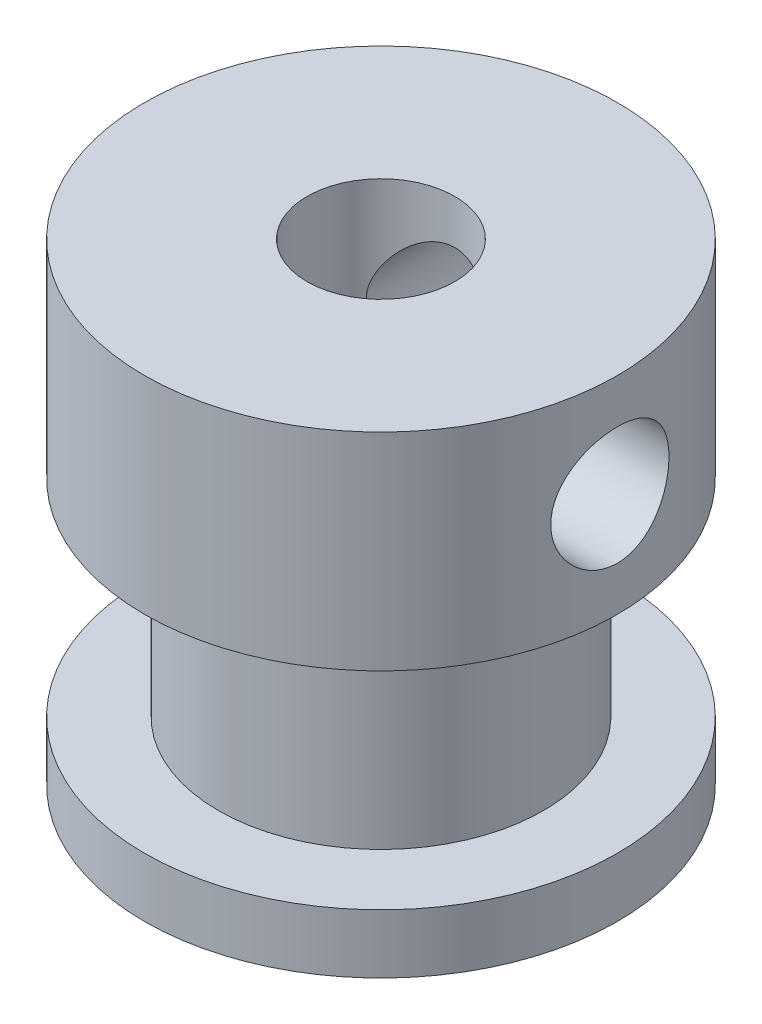
ISO-10303-21;
HEADER;
FILE_DESCRIPTION(('STEP AP214'),'2;1');
FILE_NAME('part.step','',(''),(''),'','','');
FILE_SCHEMA(('AUTOMOTIVE_DESIGN { 1 0 10303 214 1 1 1 1 }'));
ENDSEC;
DATA;
#1=APPLICATION_CONTEXT('core data for automotive mechanical design processes');
#2=APPLICATION_PROTOCOL_DEFINITION('international standard','automotive_design',2000,#1);
#3=PRODUCT_CONTEXT('',#1,'mechanical');
#4=PRODUCT('Part','Part','',(#3));
#5=PRODUCT_RELATED_PRODUCT_CATEGORY('part','',(#4));
#6=PRODUCT_DEFINITION_FORMATION('','',#4);
#7=PRODUCT_DEFINITION_CONTEXT('part definition',#1,'design');
#8=PRODUCT_DEFINITION('design','',#6,#7);
#9=PRODUCT_DEFINITION_SHAPE('','',#8);
#10=(LENGTH_UNIT() NAMED_UNIT(*) SI_UNIT(.MILLI.,.METRE.));
#11=(NAMED_UNIT(*) PLANE_ANGLE_UNIT() SI_UNIT($,.RADIAN.));
#12=(NAMED_UNIT(*) SI_UNIT($,.STERADIAN.) SOLID_ANGLE_UNIT());
#13=UNCERTAINTY_MEASURE_WITH_UNIT(LENGTH_MEASURE(1.E-05),#10,'distance_accuracy_value','');
#14=(GEOMETRIC_REPRESENTATION_CONTEXT(3) GLOBAL_UNCERTAINTY_ASSIGNED_CONTEXT((#13)) GLOBAL_UNIT_ASSIGNED_CONTEXT((#10,
#11,#12)) REPRESENTATION_CONTEXT('',''));
#15=CARTESIAN_POINT('',(0.,0.,0.));
#16=DIRECTION('',(0.,0.,1.));
#17=DIRECTION('',(1.,0.,0.));
#18=AXIS2_PLACEMENT_3D('',#15,#16,#17);
#19=CARTESIAN_POINT('',(0.,2.,0.));
#20=DIRECTION('',(0.,-1.,0.));
#21=DIRECTION('',(0.,0.,-1.));
#22=AXIS2_PLACEMENT_3D('',#19,#20,#21);
#23=CYLINDRICAL_SURFACE('',#22,8.);
#24=CARTESIAN_POINT('',(0.,2.,0.));
#25=DIRECTION('',(0.,1.,0.));
#26=DIRECTION('',(0.,0.,1.));
#27=AXIS2_PLACEMENT_3D('',#24,#25,#26);
#28=CIRCLE('',#27,8.);
#29=CARTESIAN_POINT('',(0.,2.,8.));
#30=VERTEX_POINT('',#29);
#31=EDGE_CURVE('E126',#30,#30,#28,.T.);
#32=ORIENTED_EDGE('',*,*,#31,.F.);
#33=EDGE_LOOP('',(#32));
#34=FACE_BOUND('',#33,.T.);
#35=CARTESIAN_POINT('',(0.,0.,0.));
#36=DIRECTION('',(0.,1.,0.));
#37=DIRECTION('',(0.,0.,1.));
#38=AXIS2_PLACEMENT_3D('',#35,#36,#37);
#39=CIRCLE('',#38,8.);
#40=CARTESIAN_POINT('',(0.,0.,8.));
#41=VERTEX_POINT('',#40);
#42=EDGE_CURVE('E77',#41,#41,#39,.T.);
#43=ORIENTED_EDGE('',*,*,#42,.T.);
#44=EDGE_LOOP('',(#43));
#45=FACE_BOUND('',#44,.T.);
#46=ADVANCED_FACE('F38',(#34,#45),#23,.T.);
#47=CARTESIAN_POINT('',(0.,2.,0.));
#48=DIRECTION('',(0.,1.,0.));
#49=DIRECTION('',(0.,0.,1.));
#50=AXIS2_PLACEMENT_3D('',#47,#48,#49);
#51=PLANE('',#50);
#52=CARTESIAN_POINT('',(0.,2.,0.));
#53=DIRECTION('',(0.,1.,0.));
#54=DIRECTION('',(0.,0.,1.));
#55=AXIS2_PLACEMENT_3D('',#52,#53,#54);
#56=CIRCLE('',#55,5.5);
#57=CARTESIAN_POINT('',(0.,2.,5.5));
#58=VERTEX_POINT('',#57);
#59=EDGE_CURVE('E45',#58,#58,#56,.T.);
#60=ORIENTED_EDGE('',*,*,#59,.F.);
#61=EDGE_LOOP('',(#60));
#62=FACE_BOUND('',#61,.T.);
#63=ORIENTED_EDGE('',*,*,#31,.T.);
#64=EDGE_LOOP('',(#63));
#65=FACE_BOUND('',#64,.T.);
#66=ADVANCED_FACE('F110',(#62,#65),#51,.T.);
#67=CARTESIAN_POINT('',(0.,0.,0.));
#68=DIRECTION('',(0.,1.,0.));
#69=DIRECTION('',(0.,0.,1.));
#70=AXIS2_PLACEMENT_3D('',#67,#68,#69);
#71=PLANE('',#70);
#72=CARTESIAN_POINT('',(0.,0.,0.));
#73=DIRECTION('',(0.,1.,0.));
#74=DIRECTION('',(0.,0.,1.));
#75=AXIS2_PLACEMENT_3D('',#72,#73,#74);
#76=CIRCLE('',#75,2.5);
#77=CARTESIAN_POINT('',(0.,0.,2.5));
#78=VERTEX_POINT('',#77);
#79=EDGE_CURVE('E94',#78,#78,#76,.T.);
#80=ORIENTED_EDGE('',*,*,#79,.T.);
#81=EDGE_LOOP('',(#80));
#82=FACE_BOUND('',#81,.T.);
#83=ORIENTED_EDGE('',*,*,#42,.F.);
#84=EDGE_LOOP('',(#83));
#85=FACE_BOUND('',#84,.T.);
#86=ADVANCED_FACE('F108',(#82,#85),#71,.F.);
#87=CARTESIAN_POINT('',(0.,9.,0.));
#88=DIRECTION('',(0.,-1.,0.));
#89=DIRECTION('',(0.,0.,-1.));
#90=AXIS2_PLACEMENT_3D('',#87,#88,#89);
#91=CYLINDRICAL_SURFACE('',#90,5.5);
#92=CARTESIAN_POINT('',(0.,9.,0.));
#93=DIRECTION('',(0.,1.,0.));
#94=DIRECTION('',(0.,0.,1.));
#95=AXIS2_PLACEMENT_3D('',#92,#93,#94);
#96=CIRCLE('',#95,5.5);
#97=CARTESIAN_POINT('',(0.,9.,5.5));
#98=VERTEX_POINT('',#97);
#99=EDGE_CURVE('E129',#98,#98,#96,.T.);
#100=ORIENTED_EDGE('',*,*,#99,.F.);
#101=EDGE_LOOP('',(#100));
#102=FACE_BOUND('',#101,.T.);
#103=ORIENTED_EDGE('',*,*,#59,.T.);
#104=EDGE_LOOP('',(#103));
#105=FACE_BOUND('',#104,.T.);
#106=ADVANCED_FACE('F102',(#102,#105),#91,.T.);
#107=CARTESIAN_POINT('',(0.,16.,0.));
#108=DIRECTION('',(0.,-1.,0.));
#109=DIRECTION('',(0.,0.,-1.));
#110=AXIS2_PLACEMENT_3D('',#107,#108,#109);
#111=CYLINDRICAL_SURFACE('',#110,8.);
#112=CARTESIAN_POINT('',(8.00000000000003,10.5,0.));
#113=CARTESIAN_POINT('',(7.99999813157352,10.5000031009842,0.110501451559669));
#114=CARTESIAN_POINT('',(7.99768770842436,10.5091887343651,0.221037543774378));
#115=CARTESIAN_POINT('',(7.98869485106525,10.545633535076,0.438941765027404));
#116=CARTESIAN_POINT('',(7.98200993893301,10.5729029460505,0.546308062494346));
#117=CARTESIAN_POINT('',(7.96500835109376,10.6445856712828,0.754694496243463));
#118=CARTESIAN_POINT('',(7.95469603789411,10.688978398287,0.855722084573363));
#119=CARTESIAN_POINT('',(7.93153791743495,10.7935751867265,1.0488961758726));
#120=CARTESIAN_POINT('',(7.91869202472208,10.853779781492,1.14104237913171));
#121=CARTESIAN_POINT('',(7.8915655145559,10.9896010528722,1.31573590306791));
#122=CARTESIAN_POINT('',(7.87726276197501,11.0654820999454,1.39807425341477));
#123=CARTESIAN_POINT('',(7.84898160157248,11.229936273212,1.54899856960445));
#124=CARTESIAN_POINT('',(7.83500323053156,11.3185108305959,1.61758298259895));
#125=CARTESIAN_POINT('',(7.80873034264224,11.507460302316,1.74003539039866));
#126=CARTESIAN_POINT('',(7.79646392619747,11.6079909744116,1.79366962123355));
#127=CARTESIAN_POINT('',(7.77532659757355,11.8169978822134,1.88319587806768));
#128=CARTESIAN_POINT('',(7.76645514259224,11.9254728444427,1.91909074058688));
#129=CARTESIAN_POINT('',(7.7533396892843,12.1449913309355,1.97140644907305));
#130=CARTESIAN_POINT('',(7.74900654662681,12.255939861384,1.98820302444276));
#131=CARTESIAN_POINT('',(7.74519149946121,12.4791580919991,2.00301570008857));
#132=CARTESIAN_POINT('',(7.74570880570571,12.5914275742562,2.00103485575751));
#133=CARTESIAN_POINT('',(7.75145607355755,12.8112210769938,1.97864869951963));
#134=CARTESIAN_POINT('',(7.75657150676391,12.9187941619538,1.95869112025421));
#135=CARTESIAN_POINT('',(7.77075612894758,13.1290147345481,1.90163224920402));
#136=CARTESIAN_POINT('',(7.77982559958984,13.2316618707052,1.86452973609255));
#137=CARTESIAN_POINT('',(7.80100151874211,13.4303173550028,1.77385263724961));
#138=CARTESIAN_POINT('',(7.81313769959754,13.5262482290528,1.72011555631059));
#139=CARTESIAN_POINT('',(7.83906281127987,13.7078916130091,1.59780836801996));
#140=CARTESIAN_POINT('',(7.85285203112837,13.7936023307563,1.52923566507848));
#141=CARTESIAN_POINT('',(7.88101174053188,13.9549381542592,1.37688456624165));
#142=CARTESIAN_POINT('',(7.89538759304001,14.0302059867485,1.29272834422117));
#143=CARTESIAN_POINT('',(7.92274620771675,14.1656283232852,1.11281589000496));
#144=CARTESIAN_POINT('',(7.93572892732543,14.2257823656848,1.01705930361062));
#145=CARTESIAN_POINT('',(7.9589030945892,14.3294007816325,0.816154518241884));
#146=CARTESIAN_POINT('',(7.96908480170303,14.3728071203392,0.71097519094486));
#147=CARTESIAN_POINT('',(7.98543889321888,14.4412230742794,0.494501344190539));
#148=CARTESIAN_POINT('',(7.99161204452373,14.4662362085575,0.383207998867342));
#149=CARTESIAN_POINT('',(7.999139990285,14.4966100874118,0.160719960520065));
#150=CARTESIAN_POINT('',(8.00061404677705,14.5024573681004,0.0495956266509754));
#151=CARTESIAN_POINT('',(7.99891739752601,14.4956679972594,-0.172043833068648));
#152=CARTESIAN_POINT('',(7.99574710989129,14.4830330096012,-0.282559012859431));
#153=CARTESIAN_POINT('',(7.98519441503143,14.4400387888115,-0.498152358368626));
#154=CARTESIAN_POINT('',(7.97787512247749,14.4099449820307,-0.603286825291644));
#155=CARTESIAN_POINT('',(7.95984942178846,14.3331905546287,-0.807009723269986));
#156=CARTESIAN_POINT('',(7.94914267159857,14.2865282609158,-0.905597492043484));
#157=CARTESIAN_POINT('',(7.92524410568414,14.1770184948337,-1.09536417923977));
#158=CARTESIAN_POINT('',(7.91201156489243,14.1138985168043,-1.18638058911441));
#159=CARTESIAN_POINT('',(7.88459345583226,13.9736134549374,-1.3567021515243));
#160=CARTESIAN_POINT('',(7.87040772335607,13.8964459471775,-1.43600527863065));
#161=CARTESIAN_POINT('',(7.84225275947695,13.7279973855407,-1.58265409076361));
#162=CARTESIAN_POINT('',(7.82829738916375,13.6364163959968,-1.64965849016268));
#163=CARTESIAN_POINT('',(7.80257171169652,13.4430231540457,-1.76734767868357));
#164=CARTESIAN_POINT('',(7.79080130756035,13.3412113560537,-1.81803319221055));
#165=CARTESIAN_POINT('',(7.77090792979554,13.1307923701159,-1.90126856081236));
#166=CARTESIAN_POINT('',(7.76276340389208,13.0222298288747,-1.93392586220539));
#167=CARTESIAN_POINT('',(7.75102325453579,12.8009204828145,-1.98046087993834));
#168=CARTESIAN_POINT('',(7.74742663626582,12.6881745986233,-1.99434270330485));
#169=CARTESIAN_POINT('',(7.7452653493861,12.4651719681931,-2.0027181204453));
#170=CARTESIAN_POINT('',(7.74655910304352,12.354936753167,-1.99775719704013));
#171=CARTESIAN_POINT('',(7.75370545343791,12.1369281484427,-1.9698363710838));
#172=CARTESIAN_POINT('',(7.7595579585581,12.0291547093151,-1.946876830249));
#173=CARTESIAN_POINT('',(7.77508347576964,11.8197220545795,-1.8839084259237));
#174=CARTESIAN_POINT('',(7.78473353648413,11.7180302596797,-1.84400187290714));
#175=CARTESIAN_POINT('',(7.80677007633105,11.5227128230484,-1.74835321814007));
#176=CARTESIAN_POINT('',(7.81915693494365,11.4290883024174,-1.69260892004556));
#177=CARTESIAN_POINT('',(7.8456751235135,11.2499271613306,-1.56515699818282));
#178=CARTESIAN_POINT('',(7.8598435310901,11.1646652354347,-1.49307088388298));
#179=CARTESIAN_POINT('',(7.88810702995048,11.0072706069395,-1.33571916158629));
#180=CARTESIAN_POINT('',(7.90220210302747,10.935141026516,-1.25045042834817));
#181=CARTESIAN_POINT('',(7.92903540863551,10.8047849219139,-1.06729011560343));
#182=CARTESIAN_POINT('',(7.94174444487824,10.7468338484379,-0.969197896421822));
#183=CARTESIAN_POINT('',(7.96406566633491,10.6483367160793,-0.764354746013941));
#184=CARTESIAN_POINT('',(7.97368006933042,10.607778185802,-0.657610084582292));
#185=CARTESIAN_POINT('',(7.98730746087389,10.5512375595605,-0.459213670991268));
#186=CARTESIAN_POINT('',(7.9920344673692,10.5320650092621,-0.368506894544063));
#187=CARTESIAN_POINT('',(7.99838140309265,10.5064454085041,-0.185208095381683));
#188=CARTESIAN_POINT('',(8.00000156601195,10.4999974009263,-0.092616214990127));
#189=CARTESIAN_POINT('',(8.00000000000003,10.5,0.));
#190=B_SPLINE_CURVE_WITH_KNOTS('',3,(#112,#113,#114,#115,#116,#117,#118,#119,#120,#121,#122,
#123,#124,#125,#126,#127,#128,#129,#130,#131,#132,#133,#134,#135,#136,#137,#138,#139,#140,#141,
#142,#143,#144,#145,#146,#147,#148,#149,#150,#151,#152,#153,#154,#155,#156,#157,#158,#159,#160,
#161,#162,#163,#164,#165,#166,#167,#168,#169,#170,#171,#172,#173,#174,#175,#176,#177,#178,#179,
#180,#181,#182,#183,#184,#185,#186,#187,#188,#189),.UNSPECIFIED.,.T.,.F.,(4,2,2,2,2,2,2,2,2,2,2,
2,2,2,2,2,2,2,2,2,2,2,2,2,2,2,2,2,2,2,2,2,2,2,2,2,2,2,4),(0.,0.331164949962519,
0.662517650351866,0.993473203048142,1.32443992022577,1.66152580582852,1.99864972773416,
2.34078196727742,2.68285948225824,3.01808393468093,3.3532538415469,3.68029996013785,
4.00736937959145,4.337740371696,4.66816921119311,5.00802001296453,5.34788119415424,
5.68890972016579,6.02987298255951,6.36211078603462,6.69431868154751,7.02160366023144,
7.34892169767481,7.68204783424897,8.01523150681786,8.35659345610395,8.69794025003772,
9.03723006156476,9.37644564340971,9.70591707202577,10.0353818794581,10.3628853408369,
10.6904342418696,11.0265276855097,11.3627009303165,11.7049624733721,12.0469781843289,
12.3245632392729,12.6021274139515),.UNSPECIFIED.);
#191=CARTESIAN_POINT('',(8.00000000000003,10.5,0.));
#192=VERTEX_POINT('',#191);
#193=EDGE_CURVE('E61',#192,#192,#190,.T.);
#194=ORIENTED_EDGE('',*,*,#193,.T.);
#195=EDGE_LOOP('',(#194));
#196=FACE_BOUND('',#195,.T.);
#197=CARTESIAN_POINT('',(0.,14.5,-8.));
#198=CARTESIAN_POINT('',(-0.110501451559641,14.4999968990158,-7.9999981315735));
#199=CARTESIAN_POINT('',(-0.221037543774351,14.490811265635,-7.99768770842435));
#200=CARTESIAN_POINT('',(-0.438941765027377,14.454366464924,-7.98869485106526));
#201=CARTESIAN_POINT('',(-0.546308062494319,14.4270970539495,-7.98200993893301));
#202=CARTESIAN_POINT('',(-0.754694496243435,14.3554143287172,-7.96500835109376));
#203=CARTESIAN_POINT('',(-0.855722084573335,14.311021601713,-7.95469603789411));
#204=CARTESIAN_POINT('',(-1.04889617587257,14.2064248132735,-7.93153791743495));
#205=CARTESIAN_POINT('',(-1.14104237913168,14.146220218508,-7.91869202472209));
#206=CARTESIAN_POINT('',(-1.31573590306789,14.0103989471278,-7.89156551455591));
#207=CARTESIAN_POINT('',(-1.39807425341474,13.9345179000546,-7.87726276197502));
#208=CARTESIAN_POINT('',(-1.54899856960443,13.770063726788,-7.84898160157248));
#209=CARTESIAN_POINT('',(-1.61758298259892,13.6814891694041,-7.83500323053157));
#210=CARTESIAN_POINT('',(-1.74003539039863,13.492539697684,-7.80873034264225));
#211=CARTESIAN_POINT('',(-1.79366962123352,13.3920090255884,-7.79646392619748));
#212=CARTESIAN_POINT('',(-1.88319587806766,13.1830021177866,-7.77532659757355));
#213=CARTESIAN_POINT('',(-1.91909074058685,13.0745271555573,-7.76645514259224));
#214=CARTESIAN_POINT('',(-1.97140644907302,12.8550086690645,-7.7533396892843));
#215=CARTESIAN_POINT('',(-1.98820302444274,12.744060138616,-7.74900654662681));
#216=CARTESIAN_POINT('',(-2.00301570008854,12.5208419080009,-7.74519149946122));
#217=CARTESIAN_POINT('',(-2.00103485575748,12.4085724257438,-7.74570880570571));
#218=CARTESIAN_POINT('',(-1.97864869951961,12.1887789230062,-7.75145607355756));
#219=CARTESIAN_POINT('',(-1.95869112025418,12.0812058380462,-7.75657150676391));
#220=CARTESIAN_POINT('',(-1.90163224920399,11.8709852654519,-7.77075612894758));
#221=CARTESIAN_POINT('',(-1.86452973609252,11.7683381292948,-7.77982559958985));
#222=CARTESIAN_POINT('',(-1.77385263724958,11.5696826449972,-7.80100151874212));
#223=CARTESIAN_POINT('',(-1.72011555631056,11.4737517709472,-7.81313769959755));
#224=CARTESIAN_POINT('',(-1.59780836801993,11.2921083869909,-7.83906281127988));
#225=CARTESIAN_POINT('',(-1.52923566507845,11.2063976692437,-7.85285203112837));
#226=CARTESIAN_POINT('',(-1.37688456624163,11.0450618457408,-7.88101174053188));
#227=CARTESIAN_POINT('',(-1.29272834422115,10.9697940132515,-7.89538759304001));
#228=CARTESIAN_POINT('',(-1.11281589000493,10.8343716767148,-7.92274620771675));
#229=CARTESIAN_POINT('',(-1.01705930361059,10.7742176343152,-7.93572892732543));
#230=CARTESIAN_POINT('',(-0.816154518241856,10.6705992183675,-7.9589030945892));
#231=CARTESIAN_POINT('',(-0.710975190944832,10.6271928796608,-7.96908480170303));
#232=CARTESIAN_POINT('',(-0.494501344190511,10.5587769257206,-7.98543889321888));
#233=CARTESIAN_POINT('',(-0.383207998867313,10.5337637914425,-7.99161204452374));
#234=CARTESIAN_POINT('',(-0.160719960520036,10.5033899125882,-7.999139990285));
#235=CARTESIAN_POINT('',(-0.0495956266509467,10.4975426318996,-8.00061404677705));
#236=CARTESIAN_POINT('',(0.172043833068677,10.5043320027407,-7.99891739752601));
#237=CARTESIAN_POINT('',(0.28255901285946,10.5169669903988,-7.99574710989128));
#238=CARTESIAN_POINT('',(0.498152358368655,10.5599612111885,-7.98519441503143));
#239=CARTESIAN_POINT('',(0.603286825291673,10.5900550179693,-7.97787512247748));
#240=CARTESIAN_POINT('',(0.807009723270015,10.6668094453713,-7.95984942178845));
#241=CARTESIAN_POINT('',(0.905597492043513,10.7134717390842,-7.94914267159856));
#242=CARTESIAN_POINT('',(1.0953641792398,10.8229815051663,-7.92524410568414));
#243=CARTESIAN_POINT('',(1.18638058911444,10.8861014831957,-7.91201156489243));
#244=CARTESIAN_POINT('',(1.35670215152433,11.0263865450626,-7.88459345583226));
#245=CARTESIAN_POINT('',(1.43600527863068,11.1035540528225,-7.87040772335606));
#246=CARTESIAN_POINT('',(1.58265409076364,11.2720026144593,-7.84225275947695));
#247=CARTESIAN_POINT('',(1.64965849016271,11.3635836040032,-7.82829738916375));
#248=CARTESIAN_POINT('',(1.7673476786836,11.5569768459543,-7.80257171169652));
#249=CARTESIAN_POINT('',(1.81803319221058,11.6587886439463,-7.79080130756035));
#250=CARTESIAN_POINT('',(1.90126856081239,11.8692076298841,-7.77090792979553));
#251=CARTESIAN_POINT('',(1.93392586220542,11.9777701711253,-7.76276340389207));
#252=CARTESIAN_POINT('',(1.98046087993837,12.1990795171855,-7.75102325453578));
#253=CARTESIAN_POINT('',(1.99434270330488,12.3118254013767,-7.74742663626581));
#254=CARTESIAN_POINT('',(2.00271812044533,12.5348280318069,-7.74526534938609));
#255=CARTESIAN_POINT('',(1.99775719704016,12.645063246833,-7.74655910304351));
#256=CARTESIAN_POINT('',(1.96983637108382,12.8630718515573,-7.7537054534379));
#257=CARTESIAN_POINT('',(1.94687683024903,12.9708452906849,-7.75955795855809));
#258=CARTESIAN_POINT('',(1.88390842592373,13.1802779454205,-7.77508347576963));
#259=CARTESIAN_POINT('',(1.84400187290717,13.2819697403203,-7.78473353648412));
#260=CARTESIAN_POINT('',(1.74835321814009,13.4772871769516,-7.80677007633105));
#261=CARTESIAN_POINT('',(1.69260892004558,13.5709116975826,-7.81915693494364));
#262=CARTESIAN_POINT('',(1.56515699818285,13.7500728386694,-7.8456751235135));
#263=CARTESIAN_POINT('',(1.49307088388301,13.8353347645653,-7.85984353109009));
#264=CARTESIAN_POINT('',(1.33571916158631,13.9927293930605,-7.88810702995048));
#265=CARTESIAN_POINT('',(1.25045042834819,14.064858973484,-7.90220210302746));
#266=CARTESIAN_POINT('',(1.06729011560345,14.1952150780861,-7.92903540863551));
#267=CARTESIAN_POINT('',(0.969197896421849,14.2531661515621,-7.94174444487824));
#268=CARTESIAN_POINT('',(0.764354746013968,14.3516632839207,-7.96406566633491));
#269=CARTESIAN_POINT('',(0.657610084582319,14.392221814198,-7.97368006933042));
#270=CARTESIAN_POINT('',(0.459213670991295,14.4487624404395,-7.98730746087389));
#271=CARTESIAN_POINT('',(0.368506894544091,14.4679349907379,-7.9920344673692));
#272=CARTESIAN_POINT('',(0.18520809538171,14.4935545914959,-7.99838140309264));
#273=CARTESIAN_POINT('',(0.0926162149901548,14.5000025990737,-8.00000156601192));
#274=CARTESIAN_POINT('',(0.,14.5,-8.));
#275=B_SPLINE_CURVE_WITH_KNOTS('',3,(#197,#198,#199,#200,#201,#202,#203,#204,#205,#206,#207,
#208,#209,#210,#211,#212,#213,#214,#215,#216,#217,#218,#219,#220,#221,#222,#223,#224,#225,#226,
#227,#228,#229,#230,#231,#232,#233,#234,#235,#236,#237,#238,#239,#240,#241,#242,#243,#244,#245,
#246,#247,#248,#249,#250,#251,#252,#253,#254,#255,#256,#257,#258,#259,#260,#261,#262,#263,#264,
#265,#266,#267,#268,#269,#270,#271,#272,#273,#274),.UNSPECIFIED.,.T.,.F.,(4,2,2,2,2,2,2,2,2,2,2,
2,2,2,2,2,2,2,2,2,2,2,2,2,2,2,2,2,2,2,2,2,2,2,2,2,2,2,4),(0.,0.331164949962519,
0.662517650351866,0.99347320304814,1.32443992022577,1.66152580582852,1.99864972773416,
2.34078196727742,2.68285948225824,3.01808393468093,3.3532538415469,3.68029996013785,
4.00736937959146,4.337740371696,4.66816921119311,5.00802001296453,5.34788119415424,
5.68890972016579,6.02987298255951,6.36211078603462,6.69431868154751,7.02160366023144,
7.34892169767481,7.68204783424897,8.01523150681786,8.35659345610395,8.69794025003772,
9.03723006156476,9.37644564340971,9.70591707202578,10.0353818794581,10.3628853408369,
10.6904342418696,11.0265276855097,11.3627009303165,11.7049624733721,12.0469781843289,
12.3245632392729,12.6021274139515),.UNSPECIFIED.);
#276=CARTESIAN_POINT('',(0.,14.5,-8.));
#277=VERTEX_POINT('',#276);
#278=EDGE_CURVE('E65',#277,#277,#275,.T.);
#279=ORIENTED_EDGE('',*,*,#278,.T.);
#280=EDGE_LOOP('',(#279));
#281=FACE_BOUND('',#280,.T.);
#282=CARTESIAN_POINT('',(0.,16.,0.));
#283=DIRECTION('',(0.,1.,0.));
#284=DIRECTION('',(0.,0.,1.));
#285=AXIS2_PLACEMENT_3D('',#282,#283,#284);
#286=CIRCLE('',#285,8.);
#287=CARTESIAN_POINT('',(0.,16.,8.));
#288=VERTEX_POINT('',#287);
#289=EDGE_CURVE('E131',#288,#288,#286,.T.);
#290=ORIENTED_EDGE('',*,*,#289,.F.);
#291=EDGE_LOOP('',(#290));
#292=FACE_BOUND('',#291,.T.);
#293=CARTESIAN_POINT('',(0.,9.,0.));
#294=DIRECTION('',(0.,1.,0.));
#295=DIRECTION('',(0.,0.,1.));
#296=AXIS2_PLACEMENT_3D('',#293,#294,#295);
#297=CIRCLE('',#296,8.);
#298=CARTESIAN_POINT('',(0.,9.,8.));
#299=VERTEX_POINT('',#298);
#300=EDGE_CURVE('E136',#299,#299,#297,.T.);
#301=ORIENTED_EDGE('',*,*,#300,.T.);
#302=EDGE_LOOP('',(#301));
#303=FACE_BOUND('',#302,.T.);
#304=ADVANCED_FACE('F96',(#196,#281,#292,#303),#111,.T.);
#305=CARTESIAN_POINT('',(0.,16.,0.));
#306=DIRECTION('',(0.,1.,0.));
#307=DIRECTION('',(0.,0.,1.));
#308=AXIS2_PLACEMENT_3D('',#305,#306,#307);
#309=PLANE('',#308);
#310=CARTESIAN_POINT('',(0.,16.,0.));
#311=DIRECTION('',(0.,1.,0.));
#312=DIRECTION('',(0.,0.,1.));
#313=AXIS2_PLACEMENT_3D('',#310,#311,#312);
#314=CIRCLE('',#313,2.5);
#315=CARTESIAN_POINT('',(0.,16.,2.5));
#316=VERTEX_POINT('',#315);
#317=EDGE_CURVE('E67',#316,#316,#314,.T.);
#318=ORIENTED_EDGE('',*,*,#317,.F.);
#319=EDGE_LOOP('',(#318));
#320=FACE_BOUND('',#319,.T.);
#321=ORIENTED_EDGE('',*,*,#289,.T.);
#322=EDGE_LOOP('',(#321));
#323=FACE_BOUND('',#322,.T.);
#324=ADVANCED_FACE('F101',(#320,#323),#309,.T.);
#325=CARTESIAN_POINT('',(0.,9.,0.));
#326=DIRECTION('',(0.,1.,0.));
#327=DIRECTION('',(0.,0.,1.));
#328=AXIS2_PLACEMENT_3D('',#325,#326,#327);
#329=PLANE('',#328);
#330=ORIENTED_EDGE('',*,*,#99,.T.);
#331=EDGE_LOOP('',(#330));
#332=FACE_BOUND('',#331,.T.);
#333=ORIENTED_EDGE('',*,*,#300,.F.);
#334=EDGE_LOOP('',(#333));
#335=FACE_BOUND('',#334,.T.);
#336=ADVANCED_FACE('F104',(#332,#335),#329,.F.);
#337=CARTESIAN_POINT('',(0.,0.,0.));
#338=DIRECTION('',(0.,1.,0.));
#339=DIRECTION('',(0.,0.,1.));
#340=AXIS2_PLACEMENT_3D('',#337,#338,#339);
#341=CYLINDRICAL_SURFACE('',#340,2.5);
#342=CARTESIAN_POINT('',(2.,12.5,-1.5));
#343=CARTESIAN_POINT('',(1.9999899563842,12.4249189826114,-1.5000227575991));
#344=CARTESIAN_POINT('',(1.99572243014959,12.3497210739064,-1.50575588676017));
#345=CARTESIAN_POINT('',(1.97904350434638,12.2016854705704,-1.52759797098302));
#346=CARTESIAN_POINT('',(1.96660415938922,12.1288567781879,-1.54374252679463));
#347=CARTESIAN_POINT('',(1.9288828901246,11.9623945804915,-1.59078313764401));
#348=CARTESIAN_POINT('',(1.90063587852784,11.8703574929004,-1.62485949442395));
#349=CARTESIAN_POINT('',(1.83286412912234,11.6940318598387,-1.70094533012843));
#350=CARTESIAN_POINT('',(1.79330760683741,11.6097660503329,-1.74297705283045));
#351=CARTESIAN_POINT('',(1.68777756612173,11.4196603432195,-1.84624966659378));
#352=CARTESIAN_POINT('',(1.61742363711761,11.3170334258727,-1.90894188114929));
#353=CARTESIAN_POINT('',(1.4586193506474,11.1260231647878,-2.03287996747903));
#354=CARTESIAN_POINT('',(1.37018407682201,11.0376280578861,-2.0941269976447));
#355=CARTESIAN_POINT('',(1.19476026278806,10.8928950804225,-2.1979067439451));
#356=CARTESIAN_POINT('',(1.11093376146689,10.8336737173159,-2.24174680788007));
#357=CARTESIAN_POINT('',(0.932444755507564,10.7276340400337,-2.32165152523267));
#358=CARTESIAN_POINT('',(0.837799422094952,10.6807964517991,-2.35772824500368));
#359=CARTESIAN_POINT('',(0.655317082222549,10.6082870394193,-2.41415644696378));
#360=CARTESIAN_POINT('',(0.568853585755696,10.5804174354239,-2.43610736091393));
#361=CARTESIAN_POINT('',(0.391188052921992,10.536501304746,-2.47085912284979));
#362=CARTESIAN_POINT('',(0.299988637312623,10.52044831209,-2.48366497483986));
#363=CARTESIAN_POINT('',(0.115048335136528,10.5011419067099,-2.49907968883617));
#364=CARTESIAN_POINT('',(0.0212997713727013,10.4979328073114,-2.50165324772141));
#365=CARTESIAN_POINT('',(-0.165416366428141,10.5046642348722,-2.49626936144757));
#366=CARTESIAN_POINT('',(-0.258383904122233,10.5146053703685,-2.48831142893578));
#367=CARTESIAN_POINT('',(-0.435683568436098,10.546067986313,-2.4632836571348));
#368=CARTESIAN_POINT('',(-0.520210188917499,10.5669288169561,-2.44673404857181));
#369=CARTESIAN_POINT('',(-0.684171862172426,10.6186952342522,-2.40604493660584));
#370=CARTESIAN_POINT('',(-0.76360562412977,10.6496033554976,-2.38190351809567));
#371=CARTESIAN_POINT('',(-0.923527318234433,10.7236006985885,-2.32486221996811));
#372=CARTESIAN_POINT('',(-1.00337969293305,10.7675765160147,-2.29134265660255));
#373=CARTESIAN_POINT('',(-1.15470891362336,10.8645378595917,-2.21894043646479));
#374=CARTESIAN_POINT('',(-1.22618103296473,10.9175284293631,-2.18005477975512));
#375=CARTESIAN_POINT('',(-1.37426521356107,11.0430618687988,-2.09053510980241));
#376=CARTESIAN_POINT('',(-1.44890108738507,11.1173836142049,-2.03913144290366));
#377=CARTESIAN_POINT('',(-1.58538384993671,11.2762559036507,-1.9349237792571));
#378=CARTESIAN_POINT('',(-1.6472149443604,11.3608188786743,-1.88211814269102));
#379=CARTESIAN_POINT('',(-1.75228528490804,11.5312201958179,-1.78441317626436));
#380=CARTESIAN_POINT('',(-1.79674173995946,11.6161509405137,-1.73924224553799));
#381=CARTESIAN_POINT('',(-1.87389106987978,11.7943664663345,-1.65582105773209));
#382=CARTESIAN_POINT('',(-1.90660965872838,11.8876324203376,-1.61755576516689));
#383=CARTESIAN_POINT('',(-1.95062199735974,12.0527916040278,-1.56393805143324));
#384=CARTESIAN_POINT('',(-1.96540293714784,12.1226128308979,-1.54515601955456));
#385=CARTESIAN_POINT('',(-1.98746978122375,12.2651802059541,-1.51667304681101));
#386=CARTESIAN_POINT('',(-1.99477239579985,12.3379194539107,-1.50695186390373));
#387=CARTESIAN_POINT('',(-2.0012999442642,12.4848633779274,-1.49827790293909));
#388=CARTESIAN_POINT('',(-2.00047806264257,12.5590740850574,-1.49938753445573));
#389=CARTESIAN_POINT('',(-1.99072610261057,12.7060473250374,-1.51230456185753));
#390=CARTESIAN_POINT('',(-1.98178458332098,12.7788076663875,-1.52412705251965));
#391=CARTESIAN_POINT('',(-1.95331430449204,12.9390632026618,-1.56051508430773));
#392=CARTESIAN_POINT('',(-1.9316709289088,13.0255982681308,-1.58755721486228));
#393=CARTESIAN_POINT('',(-1.87841388450525,13.1922908660855,-1.65022809339808));
#394=CARTESIAN_POINT('',(-1.84677049067316,13.2724284809031,-1.6858823654909));
#395=CARTESIAN_POINT('',(-1.75807608919816,13.4615289293493,-1.77903249993889));
#396=CARTESIAN_POINT('',(-1.69602510944931,13.5668953343252,-1.83905564347523));
#397=CARTESIAN_POINT('',(-1.55438039564658,13.764384149242,-1.96026853157683));
#398=CARTESIAN_POINT('',(-1.47476601547362,13.8564907596835,-2.02145957104429));
#399=CARTESIAN_POINT('',(-1.29702304107542,14.027462807345,-2.13993299259157));
#400=CARTESIAN_POINT('',(-1.19864860522964,14.1061226291131,-2.1971478825966));
#401=CARTESIAN_POINT('',(-0.984970277741331,14.2452665274442,-2.30083046289374));
#402=CARTESIAN_POINT('',(-0.869723203455204,14.3058096056706,-2.3473329244064));
#403=CARTESIAN_POINT('',(-0.664531994140986,14.3884905874669,-2.41163161860482));
#404=CARTESIAN_POINT('',(-0.578408265123348,14.4167173769741,-2.43384921549885));
#405=CARTESIAN_POINT('',(-0.401365381235644,14.461432134964,-2.46921550391513));
#406=CARTESIAN_POINT('',(-0.310449944179072,14.4779290645406,-2.48237111815072));
#407=CARTESIAN_POINT('',(-0.125961358052315,14.4981928241047,-2.49854699723994));
#408=CARTESIAN_POINT('',(-0.0323797561454605,14.5019132050583,-2.50153028039159));
#409=CARTESIAN_POINT('',(0.154129494971544,14.4962334907348,-2.49698719993361));
#410=CARTESIAN_POINT('',(0.247057097671179,14.4868324715917,-2.48946009629711));
#411=CARTESIAN_POINT('',(0.424484983307837,14.4563964529088,-2.46524008405095));
#412=CARTESIAN_POINT('',(0.509170159101607,14.4360106685972,-2.44905900306101));
#413=CARTESIAN_POINT('',(0.673520542356738,14.3851465786865,-2.40905201963011));
#414=CARTESIAN_POINT('',(0.75318444330352,14.354665659174,-2.3852241372675));
#415=CARTESIAN_POINT('',(0.913383591851864,14.2816254556074,-2.32886203207214));
#416=CARTESIAN_POINT('',(0.993310088153968,14.238206157889,-2.29572397002092));
#417=CARTESIAN_POINT('',(1.14486396126305,14.1423576629054,-2.22403396009593));
#418=CARTESIAN_POINT('',(1.21648689776308,14.0899236819315,-2.18547913977516));
#419=CARTESIAN_POINT('',(1.36488223995397,13.9657037869963,-2.0966685242987));
#420=CARTESIAN_POINT('',(1.4397080379364,13.8921535866846,-2.04563299169992));
#421=CARTESIAN_POINT('',(1.5766935307999,13.7348830744766,-1.9420131292006));
#422=CARTESIAN_POINT('',(1.63883728583053,13.6511501723947,-1.88942694411834));
#423=CARTESIAN_POINT('',(1.7455126136634,13.4810424554704,-1.79109125321811));
#424=CARTESIAN_POINT('',(1.79106140064658,13.3954274787839,-1.74513263017548));
#425=CARTESIAN_POINT('',(1.87016304685231,13.2156081117486,-1.66007449903139));
#426=CARTESIAN_POINT('',(1.90373836359645,13.1214202219623,-1.62096222081731));
#427=CARTESIAN_POINT('',(1.94914139922438,12.9538606732473,-1.56580101941138));
#428=CARTESIAN_POINT('',(1.96446470848963,12.8825804555928,-1.54635220628734));
#429=CARTESIAN_POINT('',(1.98726282623961,12.7369757290291,-1.51695472225641));
#430=CARTESIAN_POINT('',(1.99476751139893,12.6626639447221,-1.50696990066826));
#431=CARTESIAN_POINT('',(1.99935742227831,12.5586747856577,-1.50085460132402));
#432=CARTESIAN_POINT('',(2.00000392566845,12.5293463217565,-1.49999110491774));
#433=CARTESIAN_POINT('',(2.,12.5,-1.5));
#434=B_SPLINE_CURVE_WITH_KNOTS('',3,(#342,#343,#344,#345,#346,#347,#348,#349,#350,#351,#352,
#353,#354,#355,#356,#357,#358,#359,#360,#361,#362,#363,#364,#365,#366,#367,#368,#369,#370,#371,
#372,#373,#374,#375,#376,#377,#378,#379,#380,#381,#382,#383,#384,#385,#386,#387,#388,#389,#390,
#391,#392,#393,#394,#395,#396,#397,#398,#399,#400,#401,#402,#403,#404,#405,#406,#407,#408,#409,
#410,#411,#412,#413,#414,#415,#416,#417,#418,#419,#420,#421,#422,#423,#424,#425,#426,#427,#428,
#429,#430,#431,#432,#433),.UNSPECIFIED.,.T.,.F.,(4,2,2,2,2,2,2,2,2,2,2,2,2,2,2,2,2,2,2,2,2,2,2,
2,2,2,2,2,2,2,2,2,2,2,2,2,2,2,2,2,2,2,2,2,2,4),(0.,0.225140818813289,0.451055593895016,
0.75571438466088,1.06123795594964,1.47720804611674,1.89283253536879,2.22639303179097,
2.55943127851024,2.83862094435178,3.11765772560939,3.39765639927928,3.67766803055209,
3.94241917501297,4.20723715914625,4.49756510688428,4.78805602626152,5.13841226546404,
5.48919811771067,5.80619193384967,6.12248701337037,6.34307726284837,6.56317352160417,
6.78453876949455,7.00621641426758,7.28428560377194,7.56318925297413,7.96975811975666,
8.3768074872857,8.78961174948152,9.20105660259843,9.4798592761315,9.75844872724252,
10.0380499218877,10.3176708039936,10.5823344198312,10.8470666181456,11.1364335884202,
11.4259545900794,11.7747351905783,12.1239515037794,12.4449574092071,12.7653580273015,
12.9909138326702,13.2156045429056,13.3036035490356),.UNSPECIFIED.);
#435=CARTESIAN_POINT('',(1.76776695296637,11.5645856533065,-1.76776695296637));
#436=VERTEX_POINT('',#435);
#437=CARTESIAN_POINT('',(1.76776695296637,13.4354143466935,-1.76776695296637));
#438=VERTEX_POINT('',#437);
#439=EDGE_CURVE('E60',#436,#438,#434,.T.);
#440=ORIENTED_EDGE('',*,*,#439,.T.);
#441=CARTESIAN_POINT('',(1.49999999999999,12.5,2.00000000000001));
#442=CARTESIAN_POINT('',(1.5000227575991,12.4249189826114,1.9999899563842));
#443=CARTESIAN_POINT('',(1.50575588676016,12.3497210739064,1.99572243014959));
#444=CARTESIAN_POINT('',(1.52759797098301,12.2016854705704,1.97904350434639));
#445=CARTESIAN_POINT('',(1.54374252679463,12.1288567781879,1.96660415938923));
#446=CARTESIAN_POINT('',(1.59078313764401,11.9623945804915,1.9288828901246));
#447=CARTESIAN_POINT('',(1.62485949442394,11.8703574929004,1.90063587852784));
#448=CARTESIAN_POINT('',(1.70094533012842,11.6940318598387,1.83286412912235));
#449=CARTESIAN_POINT('',(1.74297705283045,11.6097660503329,1.79330760683741));
#450=CARTESIAN_POINT('',(1.84624966659377,11.4196603432195,1.68777756612173));
#451=CARTESIAN_POINT('',(1.90894188114929,11.3170334258727,1.61742363711761));
#452=CARTESIAN_POINT('',(2.03287996747902,11.1260231647878,1.4586193506474));
#453=CARTESIAN_POINT('',(2.0941269976447,11.0376280578861,1.37018407682201));
#454=CARTESIAN_POINT('',(2.1979067439451,10.8928950804225,1.19476026278807));
#455=CARTESIAN_POINT('',(2.24174680788007,10.8336737173159,1.1109337614669));
#456=CARTESIAN_POINT('',(2.32165152523267,10.7276340400337,0.932444755507571));
#457=CARTESIAN_POINT('',(2.35772824500367,10.6807964517991,0.837799422094958));
#458=CARTESIAN_POINT('',(2.41415644696378,10.6082870394193,0.655317082222556));
#459=CARTESIAN_POINT('',(2.43610736091392,10.5804174354239,0.568853585755701));
#460=CARTESIAN_POINT('',(2.47085912284979,10.536501304746,0.391188052921997));
#461=CARTESIAN_POINT('',(2.48366497483986,10.52044831209,0.299988637312629));
#462=CARTESIAN_POINT('',(2.49907968883617,10.5011419067099,0.115048335136533));
#463=CARTESIAN_POINT('',(2.50165324772141,10.4979328073114,0.0212997713727071));
#464=CARTESIAN_POINT('',(2.49626936144757,10.5046642348722,-0.165416366428135));
#465=CARTESIAN_POINT('',(2.48831142893578,10.5146053703685,-0.258383904122227));
#466=CARTESIAN_POINT('',(2.4632836571348,10.546067986313,-0.435683568436092));
#467=CARTESIAN_POINT('',(2.44673404857181,10.5669288169561,-0.520210188917493));
#468=CARTESIAN_POINT('',(2.40604493660584,10.6186952342522,-0.68417186217242));
#469=CARTESIAN_POINT('',(2.38190351809567,10.6496033554976,-0.763605624129764));
#470=CARTESIAN_POINT('',(2.32486221996811,10.7236006985885,-0.923527318234427));
#471=CARTESIAN_POINT('',(2.29134265660255,10.7675765160147,-1.00337969293304));
#472=CARTESIAN_POINT('',(2.21894043646479,10.8645378595917,-1.15470891362336));
#473=CARTESIAN_POINT('',(2.18005477975512,10.9175284293631,-1.22618103296472));
#474=CARTESIAN_POINT('',(2.09053510980241,11.0430618687988,-1.37426521356106));
#475=CARTESIAN_POINT('',(2.03913144290366,11.1173836142049,-1.44890108738506));
#476=CARTESIAN_POINT('',(1.9349237792571,11.2762559036507,-1.58538384993671));
#477=CARTESIAN_POINT('',(1.88211814269103,11.3608188786743,-1.6472149443604));
#478=CARTESIAN_POINT('',(1.78441317626437,11.5312201958179,-1.75228528490804));
#479=CARTESIAN_POINT('',(1.739242245538,11.6161509405137,-1.79674173995945));
#480=CARTESIAN_POINT('',(1.65582105773209,11.7943664663345,-1.87389106987978));
#481=CARTESIAN_POINT('',(1.6175557651669,11.8876324203376,-1.90660965872837));
#482=CARTESIAN_POINT('',(1.56393805143325,12.0527916040277,-1.95062199735974));
#483=CARTESIAN_POINT('',(1.54515601955457,12.1226128308979,-1.96540293714783));
#484=CARTESIAN_POINT('',(1.51667304681102,12.2651802059541,-1.98746978122375));
#485=CARTESIAN_POINT('',(1.50695186390374,12.3379194539107,-1.99477239579984));
#486=CARTESIAN_POINT('',(1.4982779029391,12.4848633779274,-2.0012999442642));
#487=CARTESIAN_POINT('',(1.49938753445574,12.5590740850574,-2.00047806264257));
#488=CARTESIAN_POINT('',(1.51230456185753,12.7060473250374,-1.99072610261057));
#489=CARTESIAN_POINT('',(1.52412705251966,12.7788076663875,-1.98178458332098));
#490=CARTESIAN_POINT('',(1.56051508430774,12.9390632026618,-1.95331430449203));
#491=CARTESIAN_POINT('',(1.58755721486229,13.0255982681308,-1.93167092890879));
#492=CARTESIAN_POINT('',(1.65022809339808,13.1922908660855,-1.87841388450525));
#493=CARTESIAN_POINT('',(1.68588236549091,13.2724284809031,-1.84677049067316));
#494=CARTESIAN_POINT('',(1.7790324999389,13.4615289293493,-1.75807608919815));
#495=CARTESIAN_POINT('',(1.83905564347524,13.5668953343252,-1.6960251094493));
#496=CARTESIAN_POINT('',(1.96026853157684,13.764384149242,-1.55438039564657));
#497=CARTESIAN_POINT('',(2.0214595710443,13.8564907596835,-1.47476601547361));
#498=CARTESIAN_POINT('',(2.13993299259158,14.027462807345,-1.29702304107541));
#499=CARTESIAN_POINT('',(2.19714788259661,14.1061226291131,-1.19864860522963));
#500=CARTESIAN_POINT('',(2.30083046289375,14.2452665274442,-0.984970277741318));
#501=CARTESIAN_POINT('',(2.34733292440641,14.3058096056706,-0.86972320345519));
#502=CARTESIAN_POINT('',(2.41163161860483,14.3884905874669,-0.664531994140972));
#503=CARTESIAN_POINT('',(2.43384921549886,14.4167173769741,-0.578408265123334));
#504=CARTESIAN_POINT('',(2.46921550391513,14.461432134964,-0.401365381235631));
#505=CARTESIAN_POINT('',(2.48237111815073,14.4779290645406,-0.310449944179058));
#506=CARTESIAN_POINT('',(2.49854699723995,14.4981928241047,-0.125961358052302));
#507=CARTESIAN_POINT('',(2.50153028039159,14.5019132050583,-0.0323797561454479));
#508=CARTESIAN_POINT('',(2.4969871999336,14.4962334907348,0.154129494971556));
#509=CARTESIAN_POINT('',(2.48946009629711,14.4868324715917,0.247057097671191));
#510=CARTESIAN_POINT('',(2.46524008405095,14.4563964529088,0.424484983307849));
#511=CARTESIAN_POINT('',(2.449059003061,14.4360106685972,0.509170159101619));
#512=CARTESIAN_POINT('',(2.4090520196301,14.3851465786865,0.673520542356749));
#513=CARTESIAN_POINT('',(2.38522413726749,14.354665659174,0.753184443303532));
#514=CARTESIAN_POINT('',(2.32886203207213,14.2816254556074,0.913383591851875));
#515=CARTESIAN_POINT('',(2.29572397002091,14.238206157889,0.993310088153979));
#516=CARTESIAN_POINT('',(2.22403396009592,14.1423576629054,1.14486396126306));
#517=CARTESIAN_POINT('',(2.18547913977515,14.0899236819315,1.21648689776309));
#518=CARTESIAN_POINT('',(2.09666852429869,13.9657037869963,1.36488223995398));
#519=CARTESIAN_POINT('',(2.04563299169992,13.8921535866846,1.43970803793641));
#520=CARTESIAN_POINT('',(1.94201312920059,13.7348830744766,1.57669353079991));
#521=CARTESIAN_POINT('',(1.88942694411833,13.6511501723947,1.63883728583054));
#522=CARTESIAN_POINT('',(1.7910912532181,13.4810424554704,1.74551261366341));
#523=CARTESIAN_POINT('',(1.74513263017547,13.3954274787839,1.79106140064659));
#524=CARTESIAN_POINT('',(1.66007449903138,13.2156081117486,1.87016304685231));
#525=CARTESIAN_POINT('',(1.6209622208173,13.1214202219623,1.90373836359645));
#526=CARTESIAN_POINT('',(1.56580101941137,12.9538606732473,1.94914139922439));
#527=CARTESIAN_POINT('',(1.54635220628733,12.8825804555928,1.96446470848964));
#528=CARTESIAN_POINT('',(1.5169547222564,12.7369757290291,1.98726282623962));
#529=CARTESIAN_POINT('',(1.50696990066825,12.6626639447221,1.99476751139894));
#530=CARTESIAN_POINT('',(1.50085460132401,12.5586747856577,1.99935742227831));
#531=CARTESIAN_POINT('',(1.49999110491774,12.5293463217565,2.00000392566845));
#532=CARTESIAN_POINT('',(1.49999999999999,12.5,2.00000000000001));
#533=B_SPLINE_CURVE_WITH_KNOTS('',3,(#441,#442,#443,#444,#445,#446,#447,#448,#449,#450,#451,
#452,#453,#454,#455,#456,#457,#458,#459,#460,#461,#462,#463,#464,#465,#466,#467,#468,#469,#470,
#471,#472,#473,#474,#475,#476,#477,#478,#479,#480,#481,#482,#483,#484,#485,#486,#487,#488,#489,
#490,#491,#492,#493,#494,#495,#496,#497,#498,#499,#500,#501,#502,#503,#504,#505,#506,#507,#508,
#509,#510,#511,#512,#513,#514,#515,#516,#517,#518,#519,#520,#521,#522,#523,#524,#525,#526,#527,
#528,#529,#530,#531,#532),.UNSPECIFIED.,.T.,.F.,(4,2,2,2,2,2,2,2,2,2,2,2,2,2,2,2,2,2,2,2,2,2,2,
2,2,2,2,2,2,2,2,2,2,2,2,2,2,2,2,2,2,2,2,2,2,4),(0.,0.225140818813289,0.451055593895016,
0.755714384660879,1.06123795594964,1.47720804611674,1.8928325353688,2.22639303179097,
2.55943127851024,2.83862094435178,3.11765772560939,3.39765639927928,3.67766803055209,
3.94241917501297,4.20723715914625,4.49756510688428,4.78805602626153,5.13841226546405,
5.48919811771067,5.80619193384967,6.12248701337037,6.34307726284837,6.56317352160417,
6.78453876949455,7.00621641426759,7.28428560377194,7.56318925297414,7.96975811975667,
8.3768074872857,8.78961174948153,9.20105660259844,9.47985927613151,9.75844872724252,
10.0380499218877,10.3176708039936,10.5823344198312,10.8470666181456,11.1364335884202,
11.4259545900794,11.7747351905783,12.1239515037794,12.4449574092071,12.7653580273015,
12.9909138326702,13.2156045429056,13.3036035490356),.UNSPECIFIED.);
#534=EDGE_CURVE('E51',#438,#436,#533,.T.);
#535=ORIENTED_EDGE('',*,*,#534,.T.);
#536=EDGE_LOOP('',(#440,#535));
#537=FACE_BOUND('',#536,.T.);
#538=ORIENTED_EDGE('',*,*,#79,.F.);
#539=EDGE_LOOP('',(#538));
#540=FACE_BOUND('',#539,.T.);
#541=ORIENTED_EDGE('',*,*,#317,.T.);
#542=EDGE_LOOP('',(#541));
#543=FACE_BOUND('',#542,.T.);
#544=ADVANCED_FACE('F58',(#537,#540,#543),#341,.F.);
#545=CARTESIAN_POINT('',(0.,12.5,-8.));
#546=DIRECTION('',(0.,0.,1.));
#547=DIRECTION('',(1.,0.,0.));
#548=AXIS2_PLACEMENT_3D('',#545,#546,#547);
#549=CYLINDRICAL_SURFACE('',#548,2.);
#550=ORIENTED_EDGE('',*,*,#439,.F.);
#551=CARTESIAN_POINT('',(0.,12.5,0.));
#552=DIRECTION('',(0.707106781186546,0.,0.707106781186549));
#553=DIRECTION('',(-0.707106781186549,0.,0.707106781186546));
#554=AXIS2_PLACEMENT_3D('',#551,#552,#553);
#555=ELLIPSE('',#554,2.82842712474619,2.);
#556=EDGE_CURVE('E11',#436,#438,#555,.T.);
#557=ORIENTED_EDGE('',*,*,#556,.T.);
#558=EDGE_LOOP('',(#550,#557));
#559=FACE_BOUND('',#558,.T.);
#560=ORIENTED_EDGE('',*,*,#278,.F.);
#561=EDGE_LOOP('',(#560));
#562=FACE_BOUND('',#561,.T.);
#563=ADVANCED_FACE('F63',(#559,#562),#549,.F.);
#564=CARTESIAN_POINT('',(8.00000000000003,12.5,0.));
#565=DIRECTION('',(-1.,0.,0.));
#566=DIRECTION('',(0.,0.,1.));
#567=AXIS2_PLACEMENT_3D('',#564,#565,#566);
#568=CYLINDRICAL_SURFACE('',#567,2.);
#569=ORIENTED_EDGE('',*,*,#556,.F.);
#570=ORIENTED_EDGE('',*,*,#534,.F.);
#571=EDGE_LOOP('',(#569,#570));
#572=FACE_BOUND('',#571,.T.);
#573=ORIENTED_EDGE('',*,*,#193,.F.);
#574=EDGE_LOOP('',(#573));
#575=FACE_BOUND('',#574,.T.);
#576=ADVANCED_FACE('F52',(#572,#575),#568,.F.);
#577=CLOSED_SHELL('',(#46,#66,#86,#106,#304,#324,#336,#544,#563,#576));
#578=MANIFOLD_SOLID_BREP('B2',#577);
#579=ADVANCED_BREP_SHAPE_REPRESENTATION('',(#18,#578),#14);
#580=SHAPE_DEFINITION_REPRESENTATION(#9,#579);
ENDSEC;
END-ISO-10303-21;
